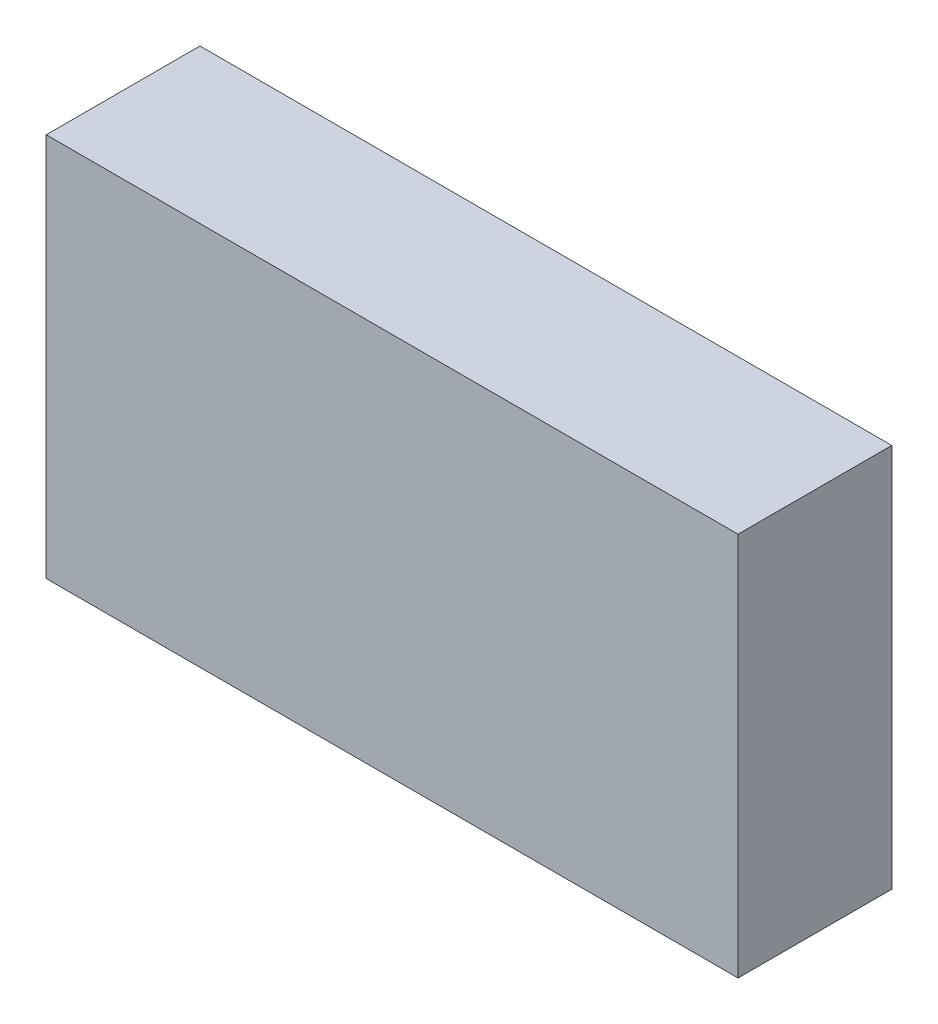
ISO-10303-21;
HEADER;
FILE_DESCRIPTION(('STEP AP214'),'2;1');
FILE_NAME('part.step','',(''),(''),'','','');
FILE_SCHEMA(('AUTOMOTIVE_DESIGN { 1 0 10303 214 1 1 1 1 }'));
ENDSEC;
DATA;
#1=APPLICATION_CONTEXT('core data for automotive mechanical design processes');
#2=APPLICATION_PROTOCOL_DEFINITION('international standard','automotive_design',2000,#1);
#3=PRODUCT_CONTEXT('',#1,'mechanical');
#4=PRODUCT('Part','Part','',(#3));
#5=PRODUCT_RELATED_PRODUCT_CATEGORY('part','',(#4));
#6=PRODUCT_DEFINITION_FORMATION('','',#4);
#7=PRODUCT_DEFINITION_CONTEXT('part definition',#1,'design');
#8=PRODUCT_DEFINITION('design','',#6,#7);
#9=PRODUCT_DEFINITION_SHAPE('','',#8);
#10=(LENGTH_UNIT() NAMED_UNIT(*) SI_UNIT(.MILLI.,.METRE.));
#11=(NAMED_UNIT(*) PLANE_ANGLE_UNIT() SI_UNIT($,.RADIAN.));
#12=(NAMED_UNIT(*) SI_UNIT($,.STERADIAN.) SOLID_ANGLE_UNIT());
#13=UNCERTAINTY_MEASURE_WITH_UNIT(LENGTH_MEASURE(1.E-05),#10,'distance_accuracy_value','');
#14=(GEOMETRIC_REPRESENTATION_CONTEXT(3) GLOBAL_UNCERTAINTY_ASSIGNED_CONTEXT((#13)) GLOBAL_UNIT_ASSIGNED_CONTEXT((#10,
#11,#12)) REPRESENTATION_CONTEXT('',''));
#15=CARTESIAN_POINT('',(0.,0.,0.));
#16=DIRECTION('',(0.,0.,1.));
#17=DIRECTION('',(1.,0.,0.));
#18=AXIS2_PLACEMENT_3D('',#15,#16,#17);
#19=CARTESIAN_POINT('',(-2.05,-1.125,0.));
#20=DIRECTION('',(1.,0.,0.));
#21=DIRECTION('',(0.,0.,1.));
#22=AXIS2_PLACEMENT_3D('',#19,#20,#21);
#23=PLANE('',#22);
#24=DIRECTION('',(0.,1.,0.));
#25=VECTOR('',#24,1.);
#26=CARTESIAN_POINT('',(-2.05,-1.125,0.1));
#27=LINE('',#26,#25);
#28=CARTESIAN_POINT('',(-2.05,-1.125,0.1));
#29=VERTEX_POINT('',#28);
#30=CARTESIAN_POINT('',(-2.05,-0.875,0.1));
#31=VERTEX_POINT('',#30);
#32=EDGE_CURVE('E11',#29,#31,#27,.T.);
#33=ORIENTED_EDGE('',*,*,#32,.T.);
#34=DIRECTION('',(0.,0.,1.));
#35=VECTOR('',#34,1.);
#36=CARTESIAN_POINT('',(-2.05,-0.875,0.));
#37=LINE('',#36,#35);
#38=CARTESIAN_POINT('',(-2.05,-0.875,0.));
#39=VERTEX_POINT('',#38);
#40=EDGE_CURVE('E24',#39,#31,#37,.T.);
#41=ORIENTED_EDGE('',*,*,#40,.F.);
#42=DIRECTION('',(0.,1.,0.));
#43=VECTOR('',#42,1.);
#44=CARTESIAN_POINT('',(-2.05,-1.125,0.));
#45=LINE('',#44,#43);
#46=CARTESIAN_POINT('',(-2.05,-1.125,0.));
#47=VERTEX_POINT('',#46);
#48=EDGE_CURVE('E86',#47,#39,#45,.T.);
#49=ORIENTED_EDGE('',*,*,#48,.F.);
#50=DIRECTION('',(0.,0.,1.));
#51=VECTOR('',#50,1.);
#52=CARTESIAN_POINT('',(-2.05,-1.125,0.));
#53=LINE('',#52,#51);
#54=EDGE_CURVE('E36',#47,#29,#53,.T.);
#55=ORIENTED_EDGE('',*,*,#54,.T.);
#56=EDGE_LOOP('',(#33,#41,#49,#55));
#57=FACE_BOUND('',#56,.T.);
#58=ADVANCED_FACE('F17',(#57),#23,.F.);
#59=CARTESIAN_POINT('',(-1.6,-1.125,0.));
#60=DIRECTION('',(1.,0.,0.));
#61=DIRECTION('',(0.,0.,1.));
#62=AXIS2_PLACEMENT_3D('',#59,#60,#61);
#63=PLANE('',#62);
#64=DIRECTION('',(0.,0.,1.));
#65=VECTOR('',#64,1.);
#66=CARTESIAN_POINT('',(-1.6,-1.125,0.));
#67=LINE('',#66,#65);
#68=CARTESIAN_POINT('',(-1.6,-1.125,0.));
#69=VERTEX_POINT('',#68);
#70=CARTESIAN_POINT('',(-1.6,-1.125,0.1));
#71=VERTEX_POINT('',#70);
#72=EDGE_CURVE('E83',#69,#71,#67,.T.);
#73=ORIENTED_EDGE('',*,*,#72,.F.);
#74=DIRECTION('',(0.,1.,0.));
#75=VECTOR('',#74,1.);
#76=CARTESIAN_POINT('',(-1.6,-1.125,0.));
#77=LINE('',#76,#75);
#78=CARTESIAN_POINT('',(-1.6,-0.875,0.));
#79=VERTEX_POINT('',#78);
#80=EDGE_CURVE('E63',#69,#79,#77,.T.);
#81=ORIENTED_EDGE('',*,*,#80,.T.);
#82=DIRECTION('',(0.,0.,1.));
#83=VECTOR('',#82,1.);
#84=CARTESIAN_POINT('',(-1.6,-0.875,0.));
#85=LINE('',#84,#83);
#86=CARTESIAN_POINT('',(-1.6,-0.875,0.1));
#87=VERTEX_POINT('',#86);
#88=EDGE_CURVE('E57',#79,#87,#85,.T.);
#89=ORIENTED_EDGE('',*,*,#88,.T.);
#90=DIRECTION('',(0.,1.,0.));
#91=VECTOR('',#90,1.);
#92=CARTESIAN_POINT('',(-1.6,-1.125,0.1));
#93=LINE('',#92,#91);
#94=EDGE_CURVE('E60',#71,#87,#93,.T.);
#95=ORIENTED_EDGE('',*,*,#94,.F.);
#96=EDGE_LOOP('',(#73,#81,#89,#95));
#97=FACE_BOUND('',#96,.T.);
#98=ADVANCED_FACE('F59',(#97),#63,.T.);
#99=CARTESIAN_POINT('',(-2.05,-1.125,0.));
#100=DIRECTION('',(0.,1.,0.));
#101=DIRECTION('',(0.,0.,1.));
#102=AXIS2_PLACEMENT_3D('',#99,#100,#101);
#103=PLANE('',#102);
#104=ORIENTED_EDGE('',*,*,#72,.T.);
#105=DIRECTION('',(1.,0.,0.));
#106=VECTOR('',#105,1.);
#107=CARTESIAN_POINT('',(-2.05,-1.125,0.1));
#108=LINE('',#107,#106);
#109=EDGE_CURVE('E71',#29,#71,#108,.T.);
#110=ORIENTED_EDGE('',*,*,#109,.F.);
#111=ORIENTED_EDGE('',*,*,#54,.F.);
#112=DIRECTION('',(1.,0.,0.));
#113=VECTOR('',#112,1.);
#114=CARTESIAN_POINT('',(-2.05,-1.125,0.));
#115=LINE('',#114,#113);
#116=EDGE_CURVE('E76',#47,#69,#115,.T.);
#117=ORIENTED_EDGE('',*,*,#116,.T.);
#118=EDGE_LOOP('',(#104,#110,#111,#117));
#119=FACE_BOUND('',#118,.T.);
#120=ADVANCED_FACE('F91',(#119),#103,.F.);
#121=CARTESIAN_POINT('',(-2.05,-0.875,0.));
#122=DIRECTION('',(0.,1.,0.));
#123=DIRECTION('',(0.,0.,1.));
#124=AXIS2_PLACEMENT_3D('',#121,#122,#123);
#125=PLANE('',#124);
#126=DIRECTION('',(1.,0.,0.));
#127=VECTOR('',#126,1.);
#128=CARTESIAN_POINT('',(-2.05,-0.875,0.));
#129=LINE('',#128,#127);
#130=EDGE_CURVE('E74',#39,#79,#129,.T.);
#131=ORIENTED_EDGE('',*,*,#130,.F.);
#132=ORIENTED_EDGE('',*,*,#40,.T.);
#133=DIRECTION('',(1.,0.,0.));
#134=VECTOR('',#133,1.);
#135=CARTESIAN_POINT('',(-2.05,-0.875,0.1));
#136=LINE('',#135,#134);
#137=EDGE_CURVE('E69',#31,#87,#136,.T.);
#138=ORIENTED_EDGE('',*,*,#137,.T.);
#139=ORIENTED_EDGE('',*,*,#88,.F.);
#140=EDGE_LOOP('',(#131,#132,#138,#139));
#141=FACE_BOUND('',#140,.T.);
#142=ADVANCED_FACE('F73',(#141),#125,.T.);
#143=CARTESIAN_POINT('',(-2.05,-1.125,0.));
#144=DIRECTION('',(0.,0.,1.));
#145=DIRECTION('',(1.,0.,0.));
#146=AXIS2_PLACEMENT_3D('',#143,#144,#145);
#147=PLANE('',#146);
#148=ORIENTED_EDGE('',*,*,#130,.T.);
#149=ORIENTED_EDGE('',*,*,#80,.F.);
#150=ORIENTED_EDGE('',*,*,#116,.F.);
#151=ORIENTED_EDGE('',*,*,#48,.T.);
#152=EDGE_LOOP('',(#148,#149,#150,#151));
#153=FACE_BOUND('',#152,.T.);
#154=ADVANCED_FACE('F89',(#153),#147,.F.);
#155=CARTESIAN_POINT('',(-2.05,-1.125,0.1));
#156=DIRECTION('',(0.,0.,1.));
#157=DIRECTION('',(1.,0.,0.));
#158=AXIS2_PLACEMENT_3D('',#155,#156,#157);
#159=PLANE('',#158);
#160=ORIENTED_EDGE('',*,*,#32,.F.);
#161=ORIENTED_EDGE('',*,*,#109,.T.);
#162=ORIENTED_EDGE('',*,*,#94,.T.);
#163=ORIENTED_EDGE('',*,*,#137,.F.);
#164=EDGE_LOOP('',(#160,#161,#162,#163));
#165=FACE_BOUND('',#164,.T.);
#166=ADVANCED_FACE('F68',(#165),#159,.T.);
#167=CLOSED_SHELL('',(#58,#98,#120,#142,#154,#166));
#168=MANIFOLD_SOLID_BREP('B1',#167);
#169=ADVANCED_BREP_SHAPE_REPRESENTATION('',(#18,#168),#14);
#170=SHAPE_DEFINITION_REPRESENTATION(#9,#169);
ENDSEC;
END-ISO-10303-21;
